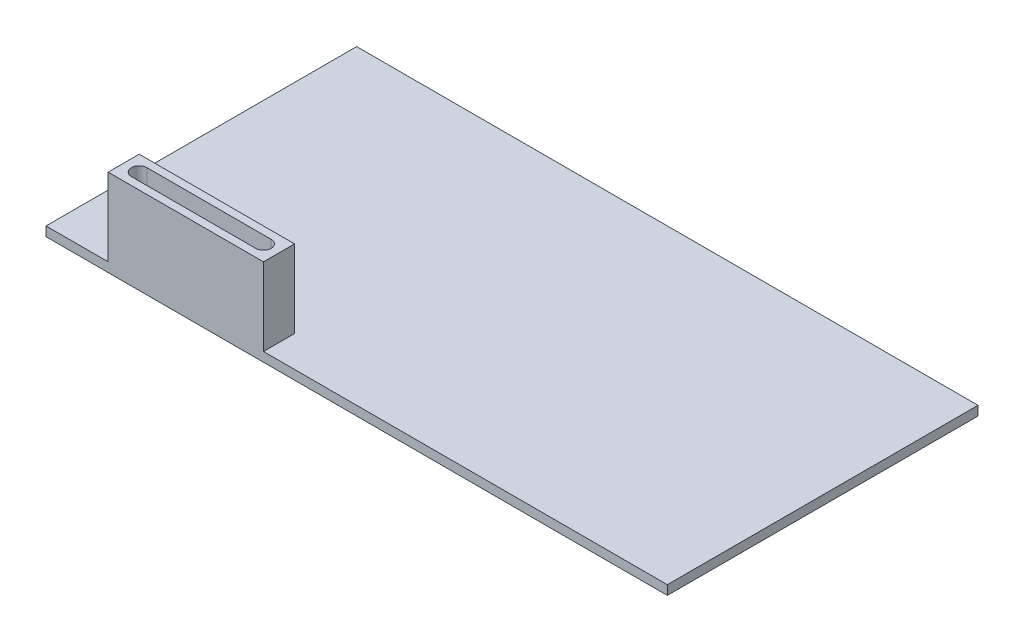
ISO-10303-21;
HEADER;
FILE_DESCRIPTION(('STEP AP214'),'2;1');
FILE_NAME('part.step','',(''),(''),'','','');
FILE_SCHEMA(('AUTOMOTIVE_DESIGN { 1 0 10303 214 1 1 1 1 }'));
ENDSEC;
DATA;
#1=APPLICATION_CONTEXT('core data for automotive mechanical design processes');
#2=APPLICATION_PROTOCOL_DEFINITION('international standard','automotive_design',2000,#1);
#3=PRODUCT_CONTEXT('',#1,'mechanical');
#4=PRODUCT('Part','Part','',(#3));
#5=PRODUCT_RELATED_PRODUCT_CATEGORY('part','',(#4));
#6=PRODUCT_DEFINITION_FORMATION('','',#4);
#7=PRODUCT_DEFINITION_CONTEXT('part definition',#1,'design');
#8=PRODUCT_DEFINITION('design','',#6,#7);
#9=PRODUCT_DEFINITION_SHAPE('','',#8);
#10=(LENGTH_UNIT() NAMED_UNIT(*) SI_UNIT(.MILLI.,.METRE.));
#11=(NAMED_UNIT(*) PLANE_ANGLE_UNIT() SI_UNIT($,.RADIAN.));
#12=(NAMED_UNIT(*) SI_UNIT($,.STERADIAN.) SOLID_ANGLE_UNIT());
#13=UNCERTAINTY_MEASURE_WITH_UNIT(LENGTH_MEASURE(1.E-05),#10,'distance_accuracy_value','');
#14=(GEOMETRIC_REPRESENTATION_CONTEXT(3) GLOBAL_UNCERTAINTY_ASSIGNED_CONTEXT((#13)) GLOBAL_UNIT_ASSIGNED_CONTEXT((#10,
#11,#12)) REPRESENTATION_CONTEXT('',''));
#15=CARTESIAN_POINT('',(0.,0.,0.));
#16=DIRECTION('',(0.,0.,1.));
#17=DIRECTION('',(1.,0.,0.));
#18=AXIS2_PLACEMENT_3D('',#15,#16,#17);
#19=CARTESIAN_POINT('',(100.,3.,-50.));
#20=DIRECTION('',(-1.,0.,0.));
#21=DIRECTION('',(0.,0.,1.));
#22=AXIS2_PLACEMENT_3D('',#19,#20,#21);
#23=PLANE('',#22);
#24=DIRECTION('',(0.,0.,-1.));
#25=VECTOR('',#24,1.);
#26=CARTESIAN_POINT('',(100.,0.,-50.));
#27=LINE('',#26,#25);
#28=CARTESIAN_POINT('',(100.,0.,50.));
#29=VERTEX_POINT('',#28);
#30=CARTESIAN_POINT('',(100.,0.,-50.));
#31=VERTEX_POINT('',#30);
#32=EDGE_CURVE('E187',#29,#31,#27,.T.);
#33=ORIENTED_EDGE('',*,*,#32,.T.);
#34=DIRECTION('',(0.,-1.,0.));
#35=VECTOR('',#34,1.);
#36=CARTESIAN_POINT('',(100.,3.,-50.));
#37=LINE('',#36,#35);
#38=CARTESIAN_POINT('',(100.,3.,-50.));
#39=VERTEX_POINT('',#38);
#40=EDGE_CURVE('E11',#39,#31,#37,.T.);
#41=ORIENTED_EDGE('',*,*,#40,.F.);
#42=DIRECTION('',(0.,0.,-1.));
#43=VECTOR('',#42,1.);
#44=CARTESIAN_POINT('',(100.,3.,-50.));
#45=LINE('',#44,#43);
#46=CARTESIAN_POINT('',(100.,3.,50.));
#47=VERTEX_POINT('',#46);
#48=EDGE_CURVE('E188',#47,#39,#45,.T.);
#49=ORIENTED_EDGE('',*,*,#48,.F.);
#50=DIRECTION('',(0.,-1.,0.));
#51=VECTOR('',#50,1.);
#52=CARTESIAN_POINT('',(100.,3.,50.));
#53=LINE('',#52,#51);
#54=EDGE_CURVE('E199',#47,#29,#53,.T.);
#55=ORIENTED_EDGE('',*,*,#54,.T.);
#56=EDGE_LOOP('',(#33,#41,#49,#55));
#57=FACE_BOUND('',#56,.T.);
#58=ADVANCED_FACE('F33',(#57),#23,.F.);
#59=CARTESIAN_POINT('',(-100.,3.,-50.));
#60=DIRECTION('',(0.,0.,1.));
#61=DIRECTION('',(1.,0.,0.));
#62=AXIS2_PLACEMENT_3D('',#59,#60,#61);
#63=PLANE('',#62);
#64=DIRECTION('',(-1.,0.,0.));
#65=VECTOR('',#64,1.);
#66=CARTESIAN_POINT('',(-100.,0.,-50.));
#67=LINE('',#66,#65);
#68=CARTESIAN_POINT('',(-100.,0.,-50.));
#69=VERTEX_POINT('',#68);
#70=EDGE_CURVE('E202',#31,#69,#67,.T.);
#71=ORIENTED_EDGE('',*,*,#70,.T.);
#72=DIRECTION('',(0.,-1.,0.));
#73=VECTOR('',#72,1.);
#74=CARTESIAN_POINT('',(-100.,3.,-50.));
#75=LINE('',#74,#73);
#76=CARTESIAN_POINT('',(-100.,3.,-50.));
#77=VERTEX_POINT('',#76);
#78=EDGE_CURVE('E40',#77,#69,#75,.T.);
#79=ORIENTED_EDGE('',*,*,#78,.F.);
#80=DIRECTION('',(-1.,0.,0.));
#81=VECTOR('',#80,1.);
#82=CARTESIAN_POINT('',(-100.,3.,-50.));
#83=LINE('',#82,#81);
#84=EDGE_CURVE('E191',#39,#77,#83,.T.);
#85=ORIENTED_EDGE('',*,*,#84,.F.);
#86=ORIENTED_EDGE('',*,*,#40,.T.);
#87=EDGE_LOOP('',(#71,#79,#85,#86));
#88=FACE_BOUND('',#87,.T.);
#89=ADVANCED_FACE('F256',(#88),#63,.F.);
#90=CARTESIAN_POINT('',(-100.,3.,-50.));
#91=DIRECTION('',(1.,0.,0.));
#92=DIRECTION('',(0.,0.,-1.));
#93=AXIS2_PLACEMENT_3D('',#90,#91,#92);
#94=PLANE('',#93);
#95=DIRECTION('',(0.,0.,1.));
#96=VECTOR('',#95,1.);
#97=CARTESIAN_POINT('',(-100.,0.,-50.));
#98=LINE('',#97,#96);
#99=CARTESIAN_POINT('',(-100.,0.,50.));
#100=VERTEX_POINT('',#99);
#101=EDGE_CURVE('E204',#69,#100,#98,.T.);
#102=ORIENTED_EDGE('',*,*,#101,.T.);
#103=DIRECTION('',(0.,-1.,0.));
#104=VECTOR('',#103,1.);
#105=CARTESIAN_POINT('',(-100.,3.,50.));
#106=LINE('',#105,#104);
#107=CARTESIAN_POINT('',(-100.,3.,50.));
#108=VERTEX_POINT('',#107);
#109=EDGE_CURVE('E209',#108,#100,#106,.T.);
#110=ORIENTED_EDGE('',*,*,#109,.F.);
#111=DIRECTION('',(0.,0.,1.));
#112=VECTOR('',#111,1.);
#113=CARTESIAN_POINT('',(-100.,3.,-50.));
#114=LINE('',#113,#112);
#115=EDGE_CURVE('E194',#77,#108,#114,.T.);
#116=ORIENTED_EDGE('',*,*,#115,.F.);
#117=ORIENTED_EDGE('',*,*,#78,.T.);
#118=EDGE_LOOP('',(#102,#110,#116,#117));
#119=FACE_BOUND('',#118,.T.);
#120=ADVANCED_FACE('F216',(#119),#94,.F.);
#121=CARTESIAN_POINT('',(-100.,3.,50.));
#122=DIRECTION('',(0.,0.,-1.));
#123=DIRECTION('',(-1.,0.,0.));
#124=AXIS2_PLACEMENT_3D('',#121,#122,#123);
#125=PLANE('',#124);
#126=DIRECTION('',(1.,0.,0.));
#127=VECTOR('',#126,1.);
#128=CARTESIAN_POINT('',(-100.,0.,50.));
#129=LINE('',#128,#127);
#130=EDGE_CURVE('E192',#100,#29,#129,.T.);
#131=ORIENTED_EDGE('',*,*,#130,.T.);
#132=ORIENTED_EDGE('',*,*,#54,.F.);
#133=DIRECTION('',(1.,0.,0.));
#134=VECTOR('',#133,1.);
#135=CARTESIAN_POINT('',(-100.,3.,50.));
#136=LINE('',#135,#134);
#137=CARTESIAN_POINT('',(-30.,3.,50.));
#138=VERTEX_POINT('',#137);
#139=EDGE_CURVE('E196',#138,#47,#136,.T.);
#140=ORIENTED_EDGE('',*,*,#139,.F.);
#141=DIRECTION('',(0.,-1.,0.));
#142=VECTOR('',#141,1.);
#143=CARTESIAN_POINT('',(-30.,28.,50.));
#144=LINE('',#143,#142);
#145=CARTESIAN_POINT('',(-30.,28.,50.));
#146=VERTEX_POINT('',#145);
#147=EDGE_CURVE('E181',#146,#138,#144,.T.);
#148=ORIENTED_EDGE('',*,*,#147,.F.);
#149=DIRECTION('',(1.,0.,0.));
#150=VECTOR('',#149,1.);
#151=CARTESIAN_POINT('',(-80.,28.,50.));
#152=LINE('',#151,#150);
#153=CARTESIAN_POINT('',(-80.,28.,50.));
#154=VERTEX_POINT('',#153);
#155=EDGE_CURVE('E161',#154,#146,#152,.T.);
#156=ORIENTED_EDGE('',*,*,#155,.F.);
#157=DIRECTION('',(0.,-1.,0.));
#158=VECTOR('',#157,1.);
#159=CARTESIAN_POINT('',(-80.,28.,50.));
#160=LINE('',#159,#158);
#161=CARTESIAN_POINT('',(-80.,3.,50.));
#162=VERTEX_POINT('',#161);
#163=EDGE_CURVE('E184',#154,#162,#160,.T.);
#164=ORIENTED_EDGE('',*,*,#163,.T.);
#165=EDGE_CURVE('E197',#108,#162,#136,.T.);
#166=ORIENTED_EDGE('',*,*,#165,.F.);
#167=ORIENTED_EDGE('',*,*,#109,.T.);
#168=EDGE_LOOP('',(#131,#132,#140,#148,#156,#164,#166,#167));
#169=FACE_BOUND('',#168,.T.);
#170=ADVANCED_FACE('F223',(#169),#125,.F.);
#171=CARTESIAN_POINT('',(0.,3.,0.));
#172=DIRECTION('',(0.,1.,0.));
#173=DIRECTION('',(0.,0.,1.));
#174=AXIS2_PLACEMENT_3D('',#171,#172,#173);
#175=PLANE('',#174);
#176=DIRECTION('',(0.,0.,1.));
#177=VECTOR('',#176,1.);
#178=CARTESIAN_POINT('',(-80.,3.,50.));
#179=LINE('',#178,#177);
#180=CARTESIAN_POINT('',(-80.,3.,40.));
#181=VERTEX_POINT('',#180);
#182=EDGE_CURVE('E154',#181,#162,#179,.T.);
#183=ORIENTED_EDGE('',*,*,#182,.F.);
#184=DIRECTION('',(-1.,0.,0.));
#185=VECTOR('',#184,1.);
#186=CARTESIAN_POINT('',(-80.,3.,40.));
#187=LINE('',#186,#185);
#188=CARTESIAN_POINT('',(-30.,3.,40.));
#189=VERTEX_POINT('',#188);
#190=EDGE_CURVE('E162',#189,#181,#187,.T.);
#191=ORIENTED_EDGE('',*,*,#190,.F.);
#192=DIRECTION('',(0.,0.,-1.));
#193=VECTOR('',#192,1.);
#194=CARTESIAN_POINT('',(-30.,3.,50.));
#195=LINE('',#194,#193);
#196=EDGE_CURVE('E171',#138,#189,#195,.T.);
#197=ORIENTED_EDGE('',*,*,#196,.F.);
#198=ORIENTED_EDGE('',*,*,#139,.T.);
#199=ORIENTED_EDGE('',*,*,#48,.T.);
#200=ORIENTED_EDGE('',*,*,#84,.T.);
#201=ORIENTED_EDGE('',*,*,#115,.T.);
#202=ORIENTED_EDGE('',*,*,#165,.T.);
#203=EDGE_LOOP('',(#183,#191,#197,#198,#199,#200,#201,#202));
#204=FACE_BOUND('',#203,.T.);
#205=ADVANCED_FACE('F230',(#204),#175,.T.);
#206=CARTESIAN_POINT('',(0.,0.,0.));
#207=DIRECTION('',(0.,1.,0.));
#208=DIRECTION('',(0.,0.,1.));
#209=AXIS2_PLACEMENT_3D('',#206,#207,#208);
#210=PLANE('',#209);
#211=DIRECTION('',(-1.,0.,0.));
#212=VECTOR('',#211,1.);
#213=CARTESIAN_POINT('',(-75.,0.,42.5));
#214=LINE('',#213,#212);
#215=CARTESIAN_POINT('',(-35.,0.,42.5));
#216=VERTEX_POINT('',#215);
#217=CARTESIAN_POINT('',(-75.,0.,42.5));
#218=VERTEX_POINT('',#217);
#219=EDGE_CURVE('E129',#216,#218,#214,.T.);
#220=ORIENTED_EDGE('',*,*,#219,.T.);
#221=CARTESIAN_POINT('',(-75.,0.,45.));
#222=DIRECTION('',(0.,1.,0.));
#223=DIRECTION('',(0.,0.,1.));
#224=AXIS2_PLACEMENT_3D('',#221,#222,#223);
#225=CIRCLE('',#224,2.50000000000001);
#226=CARTESIAN_POINT('',(-75.,0.,47.5));
#227=VERTEX_POINT('',#226);
#228=EDGE_CURVE('E123',#218,#227,#225,.T.);
#229=ORIENTED_EDGE('',*,*,#228,.T.);
#230=DIRECTION('',(1.,0.,0.));
#231=VECTOR('',#230,1.);
#232=CARTESIAN_POINT('',(-75.,0.,47.5));
#233=LINE('',#232,#231);
#234=CARTESIAN_POINT('',(-35.,0.,47.5));
#235=VERTEX_POINT('',#234);
#236=EDGE_CURVE('E132',#227,#235,#233,.T.);
#237=ORIENTED_EDGE('',*,*,#236,.T.);
#238=CARTESIAN_POINT('',(-35.,0.,45.));
#239=DIRECTION('',(0.,1.,0.));
#240=DIRECTION('',(0.,0.,1.));
#241=AXIS2_PLACEMENT_3D('',#238,#239,#240);
#242=CIRCLE('',#241,2.50000000000001);
#243=EDGE_CURVE('E47',#235,#216,#242,.T.);
#244=ORIENTED_EDGE('',*,*,#243,.T.);
#245=EDGE_LOOP('',(#220,#229,#237,#244));
#246=FACE_BOUND('',#245,.T.);
#247=ORIENTED_EDGE('',*,*,#32,.F.);
#248=ORIENTED_EDGE('',*,*,#130,.F.);
#249=ORIENTED_EDGE('',*,*,#101,.F.);
#250=ORIENTED_EDGE('',*,*,#70,.F.);
#251=EDGE_LOOP('',(#247,#248,#249,#250));
#252=FACE_BOUND('',#251,.T.);
#253=ADVANCED_FACE('F136',(#246,#252),#210,.F.);
#254=CARTESIAN_POINT('',(-80.,28.,50.));
#255=DIRECTION('',(1.,0.,0.));
#256=DIRECTION('',(0.,0.,-1.));
#257=AXIS2_PLACEMENT_3D('',#254,#255,#256);
#258=PLANE('',#257);
#259=ORIENTED_EDGE('',*,*,#182,.T.);
#260=ORIENTED_EDGE('',*,*,#163,.F.);
#261=DIRECTION('',(0.,0.,1.));
#262=VECTOR('',#261,1.);
#263=CARTESIAN_POINT('',(-80.,28.,50.));
#264=LINE('',#263,#262);
#265=CARTESIAN_POINT('',(-80.,28.,40.));
#266=VERTEX_POINT('',#265);
#267=EDGE_CURVE('E158',#266,#154,#264,.T.);
#268=ORIENTED_EDGE('',*,*,#267,.F.);
#269=DIRECTION('',(0.,-1.,0.));
#270=VECTOR('',#269,1.);
#271=CARTESIAN_POINT('',(-80.,28.,40.));
#272=LINE('',#271,#270);
#273=EDGE_CURVE('E168',#266,#181,#272,.T.);
#274=ORIENTED_EDGE('',*,*,#273,.T.);
#275=EDGE_LOOP('',(#259,#260,#268,#274));
#276=FACE_BOUND('',#275,.T.);
#277=ADVANCED_FACE('F243',(#276),#258,.F.);
#278=CARTESIAN_POINT('',(-30.,28.,50.));
#279=DIRECTION('',(-1.,0.,0.));
#280=DIRECTION('',(0.,0.,1.));
#281=AXIS2_PLACEMENT_3D('',#278,#279,#280);
#282=PLANE('',#281);
#283=ORIENTED_EDGE('',*,*,#196,.T.);
#284=DIRECTION('',(0.,-1.,0.));
#285=VECTOR('',#284,1.);
#286=CARTESIAN_POINT('',(-30.,28.,40.));
#287=LINE('',#286,#285);
#288=CARTESIAN_POINT('',(-30.,28.,40.));
#289=VERTEX_POINT('',#288);
#290=EDGE_CURVE('E178',#289,#189,#287,.T.);
#291=ORIENTED_EDGE('',*,*,#290,.F.);
#292=DIRECTION('',(0.,0.,-1.));
#293=VECTOR('',#292,1.);
#294=CARTESIAN_POINT('',(-30.,28.,50.));
#295=LINE('',#294,#293);
#296=EDGE_CURVE('E164',#146,#289,#295,.T.);
#297=ORIENTED_EDGE('',*,*,#296,.F.);
#298=ORIENTED_EDGE('',*,*,#147,.T.);
#299=EDGE_LOOP('',(#283,#291,#297,#298));
#300=FACE_BOUND('',#299,.T.);
#301=ADVANCED_FACE('F234',(#300),#282,.F.);
#302=CARTESIAN_POINT('',(-80.,28.,40.));
#303=DIRECTION('',(0.,0.,1.));
#304=DIRECTION('',(1.,0.,0.));
#305=AXIS2_PLACEMENT_3D('',#302,#303,#304);
#306=PLANE('',#305);
#307=ORIENTED_EDGE('',*,*,#190,.T.);
#308=ORIENTED_EDGE('',*,*,#273,.F.);
#309=DIRECTION('',(-1.,0.,0.));
#310=VECTOR('',#309,1.);
#311=CARTESIAN_POINT('',(-80.,28.,40.));
#312=LINE('',#311,#310);
#313=EDGE_CURVE('E166',#289,#266,#312,.T.);
#314=ORIENTED_EDGE('',*,*,#313,.F.);
#315=ORIENTED_EDGE('',*,*,#290,.T.);
#316=EDGE_LOOP('',(#307,#308,#314,#315));
#317=FACE_BOUND('',#316,.T.);
#318=ADVANCED_FACE('F245',(#317),#306,.F.);
#319=CARTESIAN_POINT('',(0.,28.,0.));
#320=DIRECTION('',(0.,-1.,0.));
#321=DIRECTION('',(0.,0.,-1.));
#322=AXIS2_PLACEMENT_3D('',#319,#320,#321);
#323=PLANE('',#322);
#324=DIRECTION('',(1.,0.,0.));
#325=VECTOR('',#324,1.);
#326=CARTESIAN_POINT('',(-75.,28.,47.5));
#327=LINE('',#326,#325);
#328=CARTESIAN_POINT('',(-75.,28.,47.5));
#329=VERTEX_POINT('',#328);
#330=CARTESIAN_POINT('',(-35.,28.,47.5));
#331=VERTEX_POINT('',#330);
#332=EDGE_CURVE('E148',#329,#331,#327,.T.);
#333=ORIENTED_EDGE('',*,*,#332,.F.);
#334=CARTESIAN_POINT('',(-75.,28.,45.));
#335=DIRECTION('',(0.,1.,0.));
#336=DIRECTION('',(0.,0.,1.));
#337=AXIS2_PLACEMENT_3D('',#334,#335,#336);
#338=CIRCLE('',#337,2.50000000000001);
#339=CARTESIAN_POINT('',(-75.,28.,42.5));
#340=VERTEX_POINT('',#339);
#341=EDGE_CURVE('E55',#340,#329,#338,.T.);
#342=ORIENTED_EDGE('',*,*,#341,.F.);
#343=DIRECTION('',(-1.,0.,0.));
#344=VECTOR('',#343,1.);
#345=CARTESIAN_POINT('',(-75.,28.,42.5));
#346=LINE('',#345,#344);
#347=CARTESIAN_POINT('',(-35.,28.,42.5));
#348=VERTEX_POINT('',#347);
#349=EDGE_CURVE('E139',#348,#340,#346,.T.);
#350=ORIENTED_EDGE('',*,*,#349,.F.);
#351=CARTESIAN_POINT('',(-35.,28.,45.));
#352=DIRECTION('',(0.,1.,0.));
#353=DIRECTION('',(0.,0.,1.));
#354=AXIS2_PLACEMENT_3D('',#351,#352,#353);
#355=CIRCLE('',#354,2.50000000000001);
#356=EDGE_CURVE('E142',#331,#348,#355,.T.);
#357=ORIENTED_EDGE('',*,*,#356,.F.);
#358=EDGE_LOOP('',(#333,#342,#350,#357));
#359=FACE_BOUND('',#358,.T.);
#360=ORIENTED_EDGE('',*,*,#267,.T.);
#361=ORIENTED_EDGE('',*,*,#155,.T.);
#362=ORIENTED_EDGE('',*,*,#296,.T.);
#363=ORIENTED_EDGE('',*,*,#313,.T.);
#364=EDGE_LOOP('',(#360,#361,#362,#363));
#365=FACE_BOUND('',#364,.T.);
#366=ADVANCED_FACE('F238',(#359,#365),#323,.F.);
#367=CARTESIAN_POINT('',(-75.,0.,45.));
#368=DIRECTION('',(0.,1.,0.));
#369=DIRECTION('',(0.,0.,1.));
#370=AXIS2_PLACEMENT_3D('',#367,#368,#369);
#371=CYLINDRICAL_SURFACE('',#370,2.50000000000001);
#372=ORIENTED_EDGE('',*,*,#341,.T.);
#373=DIRECTION('',(0.,1.,0.));
#374=VECTOR('',#373,1.);
#375=CARTESIAN_POINT('',(-75.,0.,47.5));
#376=LINE('',#375,#374);
#377=EDGE_CURVE('E119',#227,#329,#376,.T.);
#378=ORIENTED_EDGE('',*,*,#377,.F.);
#379=ORIENTED_EDGE('',*,*,#228,.F.);
#380=DIRECTION('',(0.,1.,0.));
#381=VECTOR('',#380,1.);
#382=CARTESIAN_POINT('',(-75.,0.,42.5));
#383=LINE('',#382,#381);
#384=EDGE_CURVE('E152',#218,#340,#383,.T.);
#385=ORIENTED_EDGE('',*,*,#384,.T.);
#386=EDGE_LOOP('',(#372,#378,#379,#385));
#387=FACE_BOUND('',#386,.T.);
#388=ADVANCED_FACE('F121',(#387),#371,.F.);
#389=CARTESIAN_POINT('',(-75.,0.,42.5));
#390=DIRECTION('',(0.,0.,-1.));
#391=DIRECTION('',(-1.,0.,0.));
#392=AXIS2_PLACEMENT_3D('',#389,#390,#391);
#393=PLANE('',#392);
#394=ORIENTED_EDGE('',*,*,#349,.T.);
#395=ORIENTED_EDGE('',*,*,#384,.F.);
#396=ORIENTED_EDGE('',*,*,#219,.F.);
#397=DIRECTION('',(0.,1.,0.));
#398=VECTOR('',#397,1.);
#399=CARTESIAN_POINT('',(-35.,0.,42.5));
#400=LINE('',#399,#398);
#401=EDGE_CURVE('E155',#216,#348,#400,.T.);
#402=ORIENTED_EDGE('',*,*,#401,.T.);
#403=EDGE_LOOP('',(#394,#395,#396,#402));
#404=FACE_BOUND('',#403,.T.);
#405=ADVANCED_FACE('F306',(#404),#393,.F.);
#406=CARTESIAN_POINT('',(-35.,0.,45.));
#407=DIRECTION('',(0.,1.,0.));
#408=DIRECTION('',(0.,0.,1.));
#409=AXIS2_PLACEMENT_3D('',#406,#407,#408);
#410=CYLINDRICAL_SURFACE('',#409,2.50000000000001);
#411=ORIENTED_EDGE('',*,*,#356,.T.);
#412=ORIENTED_EDGE('',*,*,#401,.F.);
#413=ORIENTED_EDGE('',*,*,#243,.F.);
#414=DIRECTION('',(0.,1.,0.));
#415=VECTOR('',#414,1.);
#416=CARTESIAN_POINT('',(-35.,0.,47.5));
#417=LINE('',#416,#415);
#418=EDGE_CURVE('E128',#235,#331,#417,.T.);
#419=ORIENTED_EDGE('',*,*,#418,.T.);
#420=EDGE_LOOP('',(#411,#412,#413,#419));
#421=FACE_BOUND('',#420,.T.);
#422=ADVANCED_FACE('F315',(#421),#410,.F.);
#423=CARTESIAN_POINT('',(-75.,0.,47.5));
#424=DIRECTION('',(0.,0.,1.));
#425=DIRECTION('',(1.,0.,0.));
#426=AXIS2_PLACEMENT_3D('',#423,#424,#425);
#427=PLANE('',#426);
#428=ORIENTED_EDGE('',*,*,#332,.T.);
#429=ORIENTED_EDGE('',*,*,#418,.F.);
#430=ORIENTED_EDGE('',*,*,#236,.F.);
#431=ORIENTED_EDGE('',*,*,#377,.T.);
#432=EDGE_LOOP('',(#428,#429,#430,#431));
#433=FACE_BOUND('',#432,.T.);
#434=ADVANCED_FACE('F133',(#433),#427,.F.);
#435=CLOSED_SHELL('',(#58,#89,#120,#170,#205,#253,#277,#301,#318,#366,#388,#405,#422,#434));
#436=MANIFOLD_SOLID_BREP('B2',#435);
#437=ADVANCED_BREP_SHAPE_REPRESENTATION('',(#18,#436),#14);
#438=SHAPE_DEFINITION_REPRESENTATION(#9,#437);
ENDSEC;
END-ISO-10303-21;
